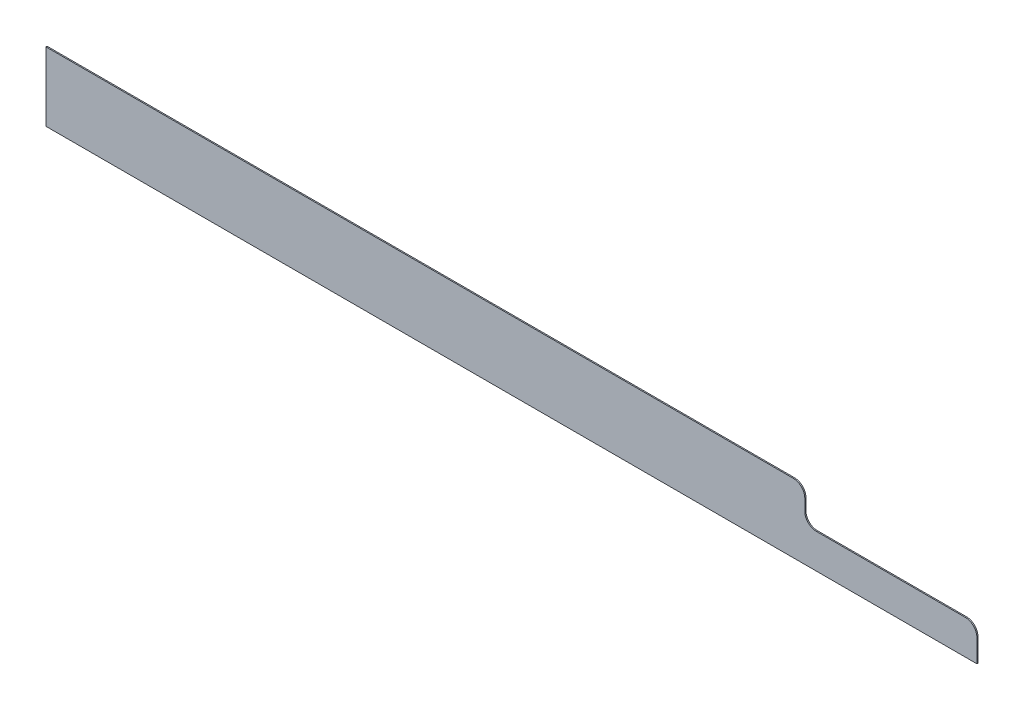
ISO-10303-21;
HEADER;
FILE_DESCRIPTION(('STEP AP214'),'2;1');
FILE_NAME('part.step','',(''),(''),'','','');
FILE_SCHEMA(('AUTOMOTIVE_DESIGN { 1 0 10303 214 1 1 1 1 }'));
ENDSEC;
DATA;
#1=APPLICATION_CONTEXT('core data for automotive mechanical design processes');
#2=APPLICATION_PROTOCOL_DEFINITION('international standard','automotive_design',2000,#1);
#3=PRODUCT_CONTEXT('',#1,'mechanical');
#4=PRODUCT('Part','Part','',(#3));
#5=PRODUCT_RELATED_PRODUCT_CATEGORY('part','',(#4));
#6=PRODUCT_DEFINITION_FORMATION('','',#4);
#7=PRODUCT_DEFINITION_CONTEXT('part definition',#1,'design');
#8=PRODUCT_DEFINITION('design','',#6,#7);
#9=PRODUCT_DEFINITION_SHAPE('','',#8);
#10=(LENGTH_UNIT() NAMED_UNIT(*) SI_UNIT(.MILLI.,.METRE.));
#11=(NAMED_UNIT(*) PLANE_ANGLE_UNIT() SI_UNIT($,.RADIAN.));
#12=(NAMED_UNIT(*) SI_UNIT($,.STERADIAN.) SOLID_ANGLE_UNIT());
#13=UNCERTAINTY_MEASURE_WITH_UNIT(LENGTH_MEASURE(1.E-05),#10,'distance_accuracy_value','');
#14=(GEOMETRIC_REPRESENTATION_CONTEXT(3) GLOBAL_UNCERTAINTY_ASSIGNED_CONTEXT((#13)) GLOBAL_UNIT_ASSIGNED_CONTEXT((#10,
#11,#12)) REPRESENTATION_CONTEXT('',''));
#15=CARTESIAN_POINT('',(0.,0.,0.));
#16=DIRECTION('',(0.,0.,1.));
#17=DIRECTION('',(1.,0.,0.));
#18=AXIS2_PLACEMENT_3D('',#15,#16,#17);
#19=CARTESIAN_POINT('',(-653.5,2.22044604925031E-13,1.99999999999989));
#20=DIRECTION('',(1.,0.,0.));
#21=DIRECTION('',(0.,0.,-1.));
#22=AXIS2_PLACEMENT_3D('',#19,#20,#21);
#23=PLANE('',#22);
#24=DIRECTION('',(0.,-1.,0.));
#25=VECTOR('',#24,1.);
#26=CARTESIAN_POINT('',(-653.5,2.22044604925031E-13,-2.22044604925031E-13));
#27=LINE('',#26,#25);
#28=CARTESIAN_POINT('',(-653.5,120.,-1.94289029309402E-13));
#29=VERTEX_POINT('',#28);
#30=CARTESIAN_POINT('',(-653.5,2.22044604925031E-13,-2.22044604925031E-13));
#31=VERTEX_POINT('',#30);
#32=EDGE_CURVE('E127',#29,#31,#27,.T.);
#33=ORIENTED_EDGE('',*,*,#32,.T.);
#34=DIRECTION('',(0.,0.,-1.));
#35=VECTOR('',#34,1.);
#36=CARTESIAN_POINT('',(-653.5,2.22044604925031E-13,1.99999999999989));
#37=LINE('',#36,#35);
#38=CARTESIAN_POINT('',(-653.5,2.22044604925031E-13,1.99999999999989));
#39=VERTEX_POINT('',#38);
#40=EDGE_CURVE('E108',#39,#31,#37,.T.);
#41=ORIENTED_EDGE('',*,*,#40,.F.);
#42=DIRECTION('',(0.,-1.,0.));
#43=VECTOR('',#42,1.);
#44=CARTESIAN_POINT('',(-653.5,2.22044604925031E-13,1.99999999999989));
#45=LINE('',#44,#43);
#46=CARTESIAN_POINT('',(-653.5,120.,2.00000000000003));
#47=VERTEX_POINT('',#46);
#48=EDGE_CURVE('E114',#47,#39,#45,.T.);
#49=ORIENTED_EDGE('',*,*,#48,.F.);
#50=DIRECTION('',(0.,0.,-1.));
#51=VECTOR('',#50,1.);
#52=CARTESIAN_POINT('',(-653.5,120.,2.00000000000003));
#53=LINE('',#52,#51);
#54=EDGE_CURVE('E133',#47,#29,#53,.T.);
#55=ORIENTED_EDGE('',*,*,#54,.T.);
#56=EDGE_LOOP('',(#33,#41,#49,#55));
#57=FACE_BOUND('',#56,.T.);
#58=ADVANCED_FACE('F32',(#57),#23,.F.);
#59=CARTESIAN_POINT('',(969.5,-2.22044604925031E-13,2.));
#60=DIRECTION('',(0.,1.,0.));
#61=DIRECTION('',(-1.,0.,0.));
#62=AXIS2_PLACEMENT_3D('',#59,#60,#61);
#63=PLANE('',#62);
#64=DIRECTION('',(1.,0.,0.));
#65=VECTOR('',#64,1.);
#66=CARTESIAN_POINT('',(969.5,-2.22044604925031E-13,0.));
#67=LINE('',#66,#65);
#68=CARTESIAN_POINT('',(969.5,-2.22044604925031E-13,0.));
#69=VERTEX_POINT('',#68);
#70=EDGE_CURVE('E182',#31,#69,#67,.T.);
#71=ORIENTED_EDGE('',*,*,#70,.T.);
#72=DIRECTION('',(0.,0.,-1.));
#73=VECTOR('',#72,1.);
#74=CARTESIAN_POINT('',(969.5,-2.22044604925031E-13,2.));
#75=LINE('',#74,#73);
#76=CARTESIAN_POINT('',(969.5,-2.22044604925031E-13,2.));
#77=VERTEX_POINT('',#76);
#78=EDGE_CURVE('E111',#77,#69,#75,.T.);
#79=ORIENTED_EDGE('',*,*,#78,.F.);
#80=DIRECTION('',(1.,0.,0.));
#81=VECTOR('',#80,1.);
#82=CARTESIAN_POINT('',(-653.5,2.22044604925031E-13,1.99999999999989));
#83=LINE('',#82,#81);
#84=EDGE_CURVE('E104',#39,#77,#83,.T.);
#85=ORIENTED_EDGE('',*,*,#84,.F.);
#86=ORIENTED_EDGE('',*,*,#40,.T.);
#87=EDGE_LOOP('',(#71,#79,#85,#86));
#88=FACE_BOUND('',#87,.T.);
#89=ADVANCED_FACE('F106',(#88),#63,.F.);
#90=CARTESIAN_POINT('',(969.5,59.9999999999998,1.99999999999989));
#91=DIRECTION('',(-1.,0.,0.));
#92=DIRECTION('',(0.,0.,1.));
#93=AXIS2_PLACEMENT_3D('',#90,#91,#92);
#94=PLANE('',#93);
#95=DIRECTION('',(0.,1.,0.));
#96=VECTOR('',#95,1.);
#97=CARTESIAN_POINT('',(969.5,59.9999999999998,1.11022302462516E-13));
#98=LINE('',#97,#96);
#99=CARTESIAN_POINT('',(969.5,40.,1.11022302462516E-13));
#100=VERTEX_POINT('',#99);
#101=EDGE_CURVE('E165',#69,#100,#98,.T.);
#102=ORIENTED_EDGE('',*,*,#101,.T.);
#103=DIRECTION('',(0.,0.,-1.));
#104=VECTOR('',#103,1.);
#105=CARTESIAN_POINT('',(969.5,39.9999999999998,2.));
#106=LINE('',#105,#104);
#107=CARTESIAN_POINT('',(969.5,39.9999999999998,2.));
#108=VERTEX_POINT('',#107);
#109=EDGE_CURVE('E152',#100,#108,#106,.F.);
#110=ORIENTED_EDGE('',*,*,#109,.T.);
#111=DIRECTION('',(0.,1.,0.));
#112=VECTOR('',#111,1.);
#113=CARTESIAN_POINT('',(969.5,59.9999999999998,1.99999999999989));
#114=LINE('',#113,#112);
#115=EDGE_CURVE('E113',#77,#108,#114,.T.);
#116=ORIENTED_EDGE('',*,*,#115,.F.);
#117=ORIENTED_EDGE('',*,*,#78,.T.);
#118=EDGE_LOOP('',(#102,#110,#116,#117));
#119=FACE_BOUND('',#118,.T.);
#120=ADVANCED_FACE('F190',(#119),#94,.F.);
#121=CARTESIAN_POINT('',(669.5,60.,1.99999999999989));
#122=DIRECTION('',(0.,-1.,0.));
#123=DIRECTION('',(1.,0.,0.));
#124=AXIS2_PLACEMENT_3D('',#121,#122,#123);
#125=PLANE('',#124);
#126=DIRECTION('',(-1.,0.,0.));
#127=VECTOR('',#126,1.);
#128=CARTESIAN_POINT('',(669.5,59.9999999999998,2.22044604925031E-13));
#129=LINE('',#128,#127);
#130=CARTESIAN_POINT('',(949.5,59.9999999999998,-1.94289029309402E-13));
#131=VERTEX_POINT('',#130);
#132=CARTESIAN_POINT('',(689.5,59.9999999999998,1.11022302462516E-13));
#133=VERTEX_POINT('',#132);
#134=EDGE_CURVE('E158',#131,#133,#129,.T.);
#135=ORIENTED_EDGE('',*,*,#134,.T.);
#136=DIRECTION('',(0.,0.,-1.));
#137=VECTOR('',#136,1.);
#138=CARTESIAN_POINT('',(689.5,59.9999999999998,1.99999999999989));
#139=LINE('',#138,#137);
#140=CARTESIAN_POINT('',(689.5,59.9999999999998,1.99999999999989));
#141=VERTEX_POINT('',#140);
#142=EDGE_CURVE('E47',#133,#141,#139,.F.);
#143=ORIENTED_EDGE('',*,*,#142,.T.);
#144=DIRECTION('',(-1.,0.,0.));
#145=VECTOR('',#144,1.);
#146=CARTESIAN_POINT('',(669.5,60.,1.99999999999989));
#147=LINE('',#146,#145);
#148=CARTESIAN_POINT('',(949.499999999999,59.9999999999998,2.00000000000014));
#149=VERTEX_POINT('',#148);
#150=EDGE_CURVE('E172',#149,#141,#147,.T.);
#151=ORIENTED_EDGE('',*,*,#150,.F.);
#152=DIRECTION('',(0.,0.,-1.));
#153=VECTOR('',#152,1.);
#154=CARTESIAN_POINT('',(949.499999999999,59.9999999999998,2.00000000000014));
#155=LINE('',#154,#153);
#156=EDGE_CURVE('E148',#149,#131,#155,.T.);
#157=ORIENTED_EDGE('',*,*,#156,.T.);
#158=EDGE_LOOP('',(#135,#143,#151,#157));
#159=FACE_BOUND('',#158,.T.);
#160=ADVANCED_FACE('F163',(#159),#125,.F.);
#161=CARTESIAN_POINT('',(669.5,120.,2.00000000000022));
#162=DIRECTION('',(-1.,0.,0.));
#163=DIRECTION('',(0.,0.,1.));
#164=AXIS2_PLACEMENT_3D('',#161,#162,#163);
#165=PLANE('',#164);
#166=DIRECTION('',(0.,1.,0.));
#167=VECTOR('',#166,1.);
#168=CARTESIAN_POINT('',(669.5,120.,0.));
#169=LINE('',#168,#167);
#170=CARTESIAN_POINT('',(669.5,79.9999999999998,-1.11022302462516E-13));
#171=VERTEX_POINT('',#170);
#172=CARTESIAN_POINT('',(669.5,99.9999999999999,-1.11022302462516E-13));
#173=VERTEX_POINT('',#172);
#174=EDGE_CURVE('E160',#171,#173,#169,.T.);
#175=ORIENTED_EDGE('',*,*,#174,.T.);
#176=DIRECTION('',(0.,0.,-1.));
#177=VECTOR('',#176,1.);
#178=CARTESIAN_POINT('',(669.5,99.9999999999999,2.));
#179=LINE('',#178,#177);
#180=CARTESIAN_POINT('',(669.5,99.9999999999999,2.));
#181=VERTEX_POINT('',#180);
#182=EDGE_CURVE('E143',#173,#181,#179,.F.);
#183=ORIENTED_EDGE('',*,*,#182,.T.);
#184=DIRECTION('',(0.,1.,0.));
#185=VECTOR('',#184,1.);
#186=CARTESIAN_POINT('',(669.5,120.,2.00000000000022));
#187=LINE('',#186,#185);
#188=CARTESIAN_POINT('',(669.5,79.9999999999998,2.00000000000033));
#189=VERTEX_POINT('',#188);
#190=EDGE_CURVE('E170',#189,#181,#187,.T.);
#191=ORIENTED_EDGE('',*,*,#190,.F.);
#192=DIRECTION('',(0.,0.,-1.));
#193=VECTOR('',#192,1.);
#194=CARTESIAN_POINT('',(669.5,79.9999999999998,-1.11022302462516E-13));
#195=LINE('',#194,#193);
#196=EDGE_CURVE('E140',#189,#171,#195,.T.);
#197=ORIENTED_EDGE('',*,*,#196,.T.);
#198=EDGE_LOOP('',(#175,#183,#191,#197));
#199=FACE_BOUND('',#198,.T.);
#200=ADVANCED_FACE('F174',(#199),#165,.F.);
#201=CARTESIAN_POINT('',(-653.5,120.,2.00000000000003));
#202=DIRECTION('',(0.,-1.,0.));
#203=DIRECTION('',(0.,0.,-1.));
#204=AXIS2_PLACEMENT_3D('',#201,#202,#203);
#205=PLANE('',#204);
#206=DIRECTION('',(-1.,0.,0.));
#207=VECTOR('',#206,1.);
#208=CARTESIAN_POINT('',(653.5,120.,1.99999999999989));
#209=LINE('',#208,#207);
#210=CARTESIAN_POINT('',(649.5,120.,2.00000000000022));
#211=VERTEX_POINT('',#210);
#212=EDGE_CURVE('E120',#211,#47,#209,.T.);
#213=ORIENTED_EDGE('',*,*,#212,.F.);
#214=DIRECTION('',(0.,0.,-1.));
#215=VECTOR('',#214,1.);
#216=CARTESIAN_POINT('',(649.5,120.,2.00000000000022));
#217=LINE('',#216,#215);
#218=CARTESIAN_POINT('',(649.5,119.999999999999,2.22044604925031E-13));
#219=VERTEX_POINT('',#218);
#220=EDGE_CURVE('E128',#211,#219,#217,.T.);
#221=ORIENTED_EDGE('',*,*,#220,.T.);
#222=DIRECTION('',(-1.,0.,0.));
#223=VECTOR('',#222,1.);
#224=CARTESIAN_POINT('',(-653.5,120.,-1.94289029309402E-13));
#225=LINE('',#224,#223);
#226=EDGE_CURVE('E124',#219,#29,#225,.T.);
#227=ORIENTED_EDGE('',*,*,#226,.T.);
#228=ORIENTED_EDGE('',*,*,#54,.F.);
#229=EDGE_LOOP('',(#213,#221,#227,#228));
#230=FACE_BOUND('',#229,.T.);
#231=ADVANCED_FACE('F213',(#230),#205,.F.);
#232=CARTESIAN_POINT('',(1.11022302462516E-13,0.,2.00000000000022));
#233=DIRECTION('',(0.,0.,-1.));
#234=DIRECTION('',(-1.,0.,0.));
#235=AXIS2_PLACEMENT_3D('',#232,#233,#234);
#236=PLANE('',#235);
#237=ORIENTED_EDGE('',*,*,#190,.T.);
#238=CARTESIAN_POINT('',(649.5,100.,1.99999999999997));
#239=DIRECTION('',(0.,0.,-1.));
#240=DIRECTION('',(-1.,0.,0.));
#241=AXIS2_PLACEMENT_3D('',#238,#239,#240);
#242=CIRCLE('',#241,20.);
#243=EDGE_CURVE('E146',#181,#211,#242,.F.);
#244=ORIENTED_EDGE('',*,*,#243,.T.);
#245=ORIENTED_EDGE('',*,*,#212,.T.);
#246=ORIENTED_EDGE('',*,*,#48,.T.);
#247=ORIENTED_EDGE('',*,*,#84,.T.);
#248=ORIENTED_EDGE('',*,*,#115,.T.);
#249=CARTESIAN_POINT('',(949.5,39.9999999999998,2.00000000000003));
#250=DIRECTION('',(0.,0.,-1.));
#251=DIRECTION('',(-1.,0.,0.));
#252=AXIS2_PLACEMENT_3D('',#249,#250,#251);
#253=CIRCLE('',#252,20.);
#254=EDGE_CURVE('E54',#108,#149,#253,.F.);
#255=ORIENTED_EDGE('',*,*,#254,.T.);
#256=ORIENTED_EDGE('',*,*,#150,.T.);
#257=CARTESIAN_POINT('',(689.500000000001,79.9999999999998,1.99999999999989));
#258=DIRECTION('',(0.,0.,-1.));
#259=DIRECTION('',(-1.,0.,0.));
#260=AXIS2_PLACEMENT_3D('',#257,#258,#259);
#261=CIRCLE('',#260,20.);
#262=EDGE_CURVE('E11',#141,#189,#261,.T.);
#263=ORIENTED_EDGE('',*,*,#262,.T.);
#264=EDGE_LOOP('',(#237,#244,#245,#246,#247,#248,#255,#256,#263));
#265=FACE_BOUND('',#264,.T.);
#266=ADVANCED_FACE('F118',(#265),#236,.F.);
#267=CARTESIAN_POINT('',(0.,0.,0.));
#268=DIRECTION('',(0.,0.,-1.));
#269=DIRECTION('',(-1.,0.,0.));
#270=AXIS2_PLACEMENT_3D('',#267,#268,#269);
#271=PLANE('',#270);
#272=ORIENTED_EDGE('',*,*,#226,.F.);
#273=CARTESIAN_POINT('',(649.5,99.9999999999999,0.));
#274=DIRECTION('',(0.,0.,-1.));
#275=DIRECTION('',(-1.,0.,0.));
#276=AXIS2_PLACEMENT_3D('',#273,#274,#275);
#277=CIRCLE('',#276,20.);
#278=EDGE_CURVE('E138',#219,#173,#277,.T.);
#279=ORIENTED_EDGE('',*,*,#278,.T.);
#280=ORIENTED_EDGE('',*,*,#174,.F.);
#281=CARTESIAN_POINT('',(689.5,80.0000000000003,0.));
#282=DIRECTION('',(0.,0.,-1.));
#283=DIRECTION('',(-1.,0.,0.));
#284=AXIS2_PLACEMENT_3D('',#281,#282,#283);
#285=CIRCLE('',#284,20.);
#286=EDGE_CURVE('E40',#171,#133,#285,.F.);
#287=ORIENTED_EDGE('',*,*,#286,.T.);
#288=ORIENTED_EDGE('',*,*,#134,.F.);
#289=CARTESIAN_POINT('',(949.5,40.,1.38777878078145E-13));
#290=DIRECTION('',(0.,0.,-1.));
#291=DIRECTION('',(-1.,0.,0.));
#292=AXIS2_PLACEMENT_3D('',#289,#290,#291);
#293=CIRCLE('',#292,20.);
#294=EDGE_CURVE('E131',#131,#100,#293,.T.);
#295=ORIENTED_EDGE('',*,*,#294,.T.);
#296=ORIENTED_EDGE('',*,*,#101,.F.);
#297=ORIENTED_EDGE('',*,*,#70,.F.);
#298=ORIENTED_EDGE('',*,*,#32,.F.);
#299=EDGE_LOOP('',(#272,#279,#280,#287,#288,#295,#296,#297,#298));
#300=FACE_BOUND('',#299,.T.);
#301=ADVANCED_FACE('F157',(#300),#271,.T.);
#302=CARTESIAN_POINT('',(649.5,100.,1.99999999999997));
#303=DIRECTION('',(0.,0.,-1.));
#304=DIRECTION('',(-1.,0.,0.));
#305=AXIS2_PLACEMENT_3D('',#302,#303,#304);
#306=CYLINDRICAL_SURFACE('',#305,20.);
#307=ORIENTED_EDGE('',*,*,#243,.F.);
#308=ORIENTED_EDGE('',*,*,#182,.F.);
#309=ORIENTED_EDGE('',*,*,#278,.F.);
#310=ORIENTED_EDGE('',*,*,#220,.F.);
#311=EDGE_LOOP('',(#307,#308,#309,#310));
#312=FACE_BOUND('',#311,.T.);
#313=ADVANCED_FACE('F197',(#312),#306,.T.);
#314=CARTESIAN_POINT('',(689.500000000001,79.9999999999998,1.99999999999989));
#315=DIRECTION('',(0.,0.,1.));
#316=DIRECTION('',(1.,0.,0.));
#317=AXIS2_PLACEMENT_3D('',#314,#315,#316);
#318=CYLINDRICAL_SURFACE('',#317,20.);
#319=ORIENTED_EDGE('',*,*,#262,.F.);
#320=ORIENTED_EDGE('',*,*,#142,.F.);
#321=ORIENTED_EDGE('',*,*,#286,.F.);
#322=ORIENTED_EDGE('',*,*,#196,.F.);
#323=EDGE_LOOP('',(#319,#320,#321,#322));
#324=FACE_BOUND('',#323,.T.);
#325=ADVANCED_FACE('F168',(#324),#318,.F.);
#326=CARTESIAN_POINT('',(949.5,39.9999999999998,2.00000000000003));
#327=DIRECTION('',(0.,0.,-1.));
#328=DIRECTION('',(-1.,0.,0.));
#329=AXIS2_PLACEMENT_3D('',#326,#327,#328);
#330=CYLINDRICAL_SURFACE('',#329,20.);
#331=ORIENTED_EDGE('',*,*,#254,.F.);
#332=ORIENTED_EDGE('',*,*,#109,.F.);
#333=ORIENTED_EDGE('',*,*,#294,.F.);
#334=ORIENTED_EDGE('',*,*,#156,.F.);
#335=EDGE_LOOP('',(#331,#332,#333,#334));
#336=FACE_BOUND('',#335,.T.);
#337=ADVANCED_FACE('F34',(#336),#330,.T.);
#338=CLOSED_SHELL('',(#58,#89,#120,#160,#200,#231,#266,#301,#313,#325,#337));
#339=MANIFOLD_SOLID_BREP('B2',#338);
#340=ADVANCED_BREP_SHAPE_REPRESENTATION('',(#18,#339),#14);
#341=SHAPE_DEFINITION_REPRESENTATION(#9,#340);
ENDSEC;
END-ISO-10303-21;
